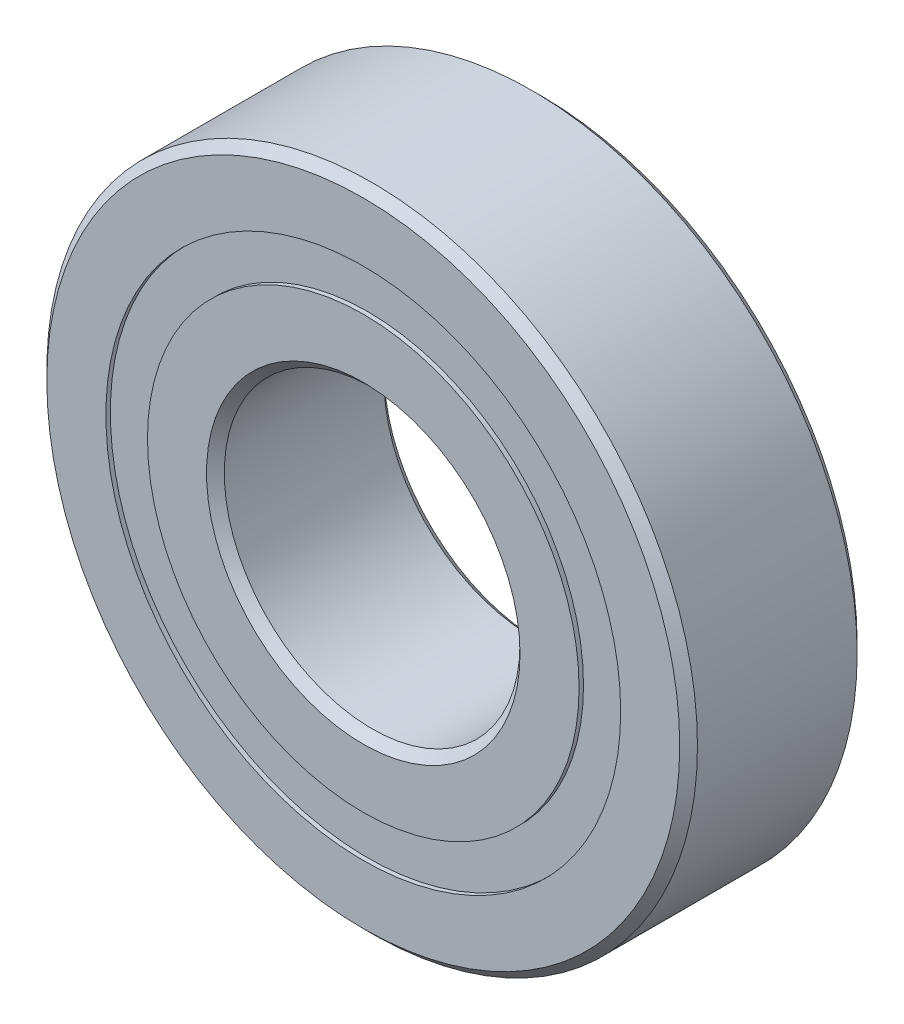
ISO-10303-21;
HEADER;
FILE_DESCRIPTION(('STEP AP214'),'2;1');
FILE_NAME('part.step','',(''),(''),'','','');
FILE_SCHEMA(('AUTOMOTIVE_DESIGN { 1 0 10303 214 1 1 1 1 }'));
ENDSEC;
DATA;
#1=APPLICATION_CONTEXT('core data for automotive mechanical design processes');
#2=APPLICATION_PROTOCOL_DEFINITION('international standard','automotive_design',2000,#1);
#3=PRODUCT_CONTEXT('',#1,'mechanical');
#4=PRODUCT('Part','Part','',(#3));
#5=PRODUCT_RELATED_PRODUCT_CATEGORY('part','',(#4));
#6=PRODUCT_DEFINITION_FORMATION('','',#4);
#7=PRODUCT_DEFINITION_CONTEXT('part definition',#1,'design');
#8=PRODUCT_DEFINITION('design','',#6,#7);
#9=PRODUCT_DEFINITION_SHAPE('','',#8);
#10=(LENGTH_UNIT() NAMED_UNIT(*) SI_UNIT(.MILLI.,.METRE.));
#11=(NAMED_UNIT(*) PLANE_ANGLE_UNIT() SI_UNIT($,.RADIAN.));
#12=(NAMED_UNIT(*) SI_UNIT($,.STERADIAN.) SOLID_ANGLE_UNIT());
#13=UNCERTAINTY_MEASURE_WITH_UNIT(LENGTH_MEASURE(1.E-05),#10,'distance_accuracy_value','');
#14=(GEOMETRIC_REPRESENTATION_CONTEXT(3) GLOBAL_UNCERTAINTY_ASSIGNED_CONTEXT((#13)) GLOBAL_UNIT_ASSIGNED_CONTEXT((#10,
#11,#12)) REPRESENTATION_CONTEXT('',''));
#15=CARTESIAN_POINT('',(0.,0.,0.));
#16=DIRECTION('',(0.,0.,1.));
#17=DIRECTION('',(1.,0.,0.));
#18=AXIS2_PLACEMENT_3D('',#15,#16,#17);
#19=CARTESIAN_POINT('',(0.,8.7032967032967,-2.85000000000001));
#20=DIRECTION('',(0.,0.,1.));
#21=DIRECTION('',(1.,0.,0.));
#22=AXIS2_PLACEMENT_3D('',#19,#20,#21);
#23=PLANE('',#22);
#24=CARTESIAN_POINT('',(0.,0.,-2.85));
#25=DIRECTION('',(0.,0.,1.));
#26=DIRECTION('',(1.,0.,0.));
#27=AXIS2_PLACEMENT_3D('',#24,#25,#26);
#28=CIRCLE('',#27,8.7032967032967);
#29=CARTESIAN_POINT('',(8.7032967032967,0.,-2.85));
#30=VERTEX_POINT('',#29);
#31=EDGE_CURVE('E56',#30,#30,#28,.T.);
#32=ORIENTED_EDGE('',*,*,#31,.F.);
#33=EDGE_LOOP('',(#32));
#34=FACE_BOUND('',#33,.T.);
#35=CARTESIAN_POINT('',(0.,0.,-2.85000000000001));
#36=DIRECTION('',(0.,0.,1.));
#37=DIRECTION('',(1.,0.,0.));
#38=AXIS2_PLACEMENT_3D('',#35,#36,#37);
#39=CIRCLE('',#38,7.2967032967033);
#40=CARTESIAN_POINT('',(7.2967032967033,0.,-2.85000000000001));
#41=VERTEX_POINT('',#40);
#42=EDGE_CURVE('E11',#41,#41,#39,.T.);
#43=ORIENTED_EDGE('',*,*,#42,.T.);
#44=EDGE_LOOP('',(#43));
#45=FACE_BOUND('',#44,.T.);
#46=ADVANCED_FACE('F42',(#34,#45),#23,.F.);
#47=CARTESIAN_POINT('',(0.,0.,3.));
#48=DIRECTION('',(0.,0.,1.));
#49=DIRECTION('',(1.,0.,0.));
#50=AXIS2_PLACEMENT_3D('',#47,#48,#49);
#51=CYLINDRICAL_SURFACE('',#50,7.2967032967033);
#52=ORIENTED_EDGE('',*,*,#42,.F.);
#53=EDGE_LOOP('',(#52));
#54=FACE_BOUND('',#53,.T.);
#55=CARTESIAN_POINT('',(0.,0.,-1.50744951180655));
#56=DIRECTION('',(0.,0.,1.));
#57=DIRECTION('',(1.,0.,0.));
#58=AXIS2_PLACEMENT_3D('',#55,#56,#57);
#59=CIRCLE('',#58,7.2967032967033);
#60=CARTESIAN_POINT('',(7.2967032967033,0.,-1.50744951180655));
#61=VERTEX_POINT('',#60);
#62=EDGE_CURVE('E48',#61,#61,#59,.T.);
#63=ORIENTED_EDGE('',*,*,#62,.T.);
#64=EDGE_LOOP('',(#63));
#65=FACE_BOUND('',#64,.T.);
#66=ADVANCED_FACE('F65',(#54,#65),#51,.F.);
#67=CARTESIAN_POINT('',(0.,8.7032967032967,-1.50744951180655));
#68=DIRECTION('',(0.,0.,-1.));
#69=DIRECTION('',(-1.,0.,0.));
#70=AXIS2_PLACEMENT_3D('',#67,#68,#69);
#71=PLANE('',#70);
#72=ORIENTED_EDGE('',*,*,#62,.F.);
#73=EDGE_LOOP('',(#72));
#74=FACE_BOUND('',#73,.T.);
#75=CARTESIAN_POINT('',(0.,0.,-1.50744951180655));
#76=DIRECTION('',(0.,0.,1.));
#77=DIRECTION('',(1.,0.,0.));
#78=AXIS2_PLACEMENT_3D('',#75,#76,#77);
#79=CIRCLE('',#78,8.7032967032967);
#80=CARTESIAN_POINT('',(8.7032967032967,0.,-1.50744951180655));
#81=VERTEX_POINT('',#80);
#82=EDGE_CURVE('E52',#81,#81,#79,.T.);
#83=ORIENTED_EDGE('',*,*,#82,.T.);
#84=EDGE_LOOP('',(#83));
#85=FACE_BOUND('',#84,.T.);
#86=ADVANCED_FACE('F69',(#74,#85),#71,.F.);
#87=CARTESIAN_POINT('',(0.,0.,3.));
#88=DIRECTION('',(0.,0.,1.));
#89=DIRECTION('',(1.,0.,0.));
#90=AXIS2_PLACEMENT_3D('',#87,#88,#89);
#91=CYLINDRICAL_SURFACE('',#90,8.7032967032967);
#92=ORIENTED_EDGE('',*,*,#82,.F.);
#93=EDGE_LOOP('',(#92));
#94=FACE_BOUND('',#93,.T.);
#95=ORIENTED_EDGE('',*,*,#31,.T.);
#96=EDGE_LOOP('',(#95));
#97=FACE_BOUND('',#96,.T.);
#98=ADVANCED_FACE('F62',(#94,#97),#91,.T.);
#99=CLOSED_SHELL('',(#46,#66,#86,#98));
#100=MANIFOLD_SOLID_BREP('B2',#99);
#101=CARTESIAN_POINT('',(0.,8.7032967032967,2.85));
#102=DIRECTION('',(0.,0.,-1.));
#103=DIRECTION('',(-1.,0.,0.));
#104=AXIS2_PLACEMENT_3D('',#101,#102,#103);
#105=PLANE('',#104);
#106=CARTESIAN_POINT('',(0.,0.,2.85));
#107=DIRECTION('',(0.,0.,1.));
#108=DIRECTION('',(1.,0.,0.));
#109=AXIS2_PLACEMENT_3D('',#106,#107,#108);
#110=CIRCLE('',#109,7.2967032967033);
#111=CARTESIAN_POINT('',(7.2967032967033,0.,2.85));
#112=VERTEX_POINT('',#111);
#113=EDGE_CURVE('E41',#112,#112,#110,.T.);
#114=ORIENTED_EDGE('',*,*,#113,.F.);
#115=EDGE_LOOP('',(#114));
#116=FACE_BOUND('',#115,.T.);
#117=CARTESIAN_POINT('',(0.,0.,2.85));
#118=DIRECTION('',(0.,0.,1.));
#119=DIRECTION('',(1.,0.,0.));
#120=AXIS2_PLACEMENT_3D('',#117,#118,#119);
#121=CIRCLE('',#120,8.7032967032967);
#122=CARTESIAN_POINT('',(8.7032967032967,0.,2.85));
#123=VERTEX_POINT('',#122);
#124=EDGE_CURVE('E124',#123,#123,#121,.T.);
#125=ORIENTED_EDGE('',*,*,#124,.T.);
#126=EDGE_LOOP('',(#125));
#127=FACE_BOUND('',#126,.T.);
#128=ADVANCED_FACE('F110',(#116,#127),#105,.F.);
#129=CARTESIAN_POINT('',(0.,0.,3.));
#130=DIRECTION('',(0.,0.,1.));
#131=DIRECTION('',(1.,0.,0.));
#132=AXIS2_PLACEMENT_3D('',#129,#130,#131);
#133=CYLINDRICAL_SURFACE('',#132,7.2967032967033);
#134=CARTESIAN_POINT('',(0.,0.,1.50744951180654));
#135=DIRECTION('',(0.,0.,1.));
#136=DIRECTION('',(1.,0.,0.));
#137=AXIS2_PLACEMENT_3D('',#134,#135,#136);
#138=CIRCLE('',#137,7.2967032967033);
#139=CARTESIAN_POINT('',(7.2967032967033,0.,1.50744951180654));
#140=VERTEX_POINT('',#139);
#141=EDGE_CURVE('E116',#140,#140,#138,.T.);
#142=ORIENTED_EDGE('',*,*,#141,.F.);
#143=EDGE_LOOP('',(#142));
#144=FACE_BOUND('',#143,.T.);
#145=ORIENTED_EDGE('',*,*,#113,.T.);
#146=EDGE_LOOP('',(#145));
#147=FACE_BOUND('',#146,.T.);
#148=ADVANCED_FACE('F139',(#144,#147),#133,.F.);
#149=CARTESIAN_POINT('',(0.,8.7032967032967,1.50744951180654));
#150=DIRECTION('',(0.,0.,1.));
#151=DIRECTION('',(1.,0.,0.));
#152=AXIS2_PLACEMENT_3D('',#149,#150,#151);
#153=PLANE('',#152);
#154=CARTESIAN_POINT('',(0.,0.,1.50744951180654));
#155=DIRECTION('',(0.,0.,1.));
#156=DIRECTION('',(1.,0.,0.));
#157=AXIS2_PLACEMENT_3D('',#154,#155,#156);
#158=CIRCLE('',#157,8.7032967032967);
#159=CARTESIAN_POINT('',(8.7032967032967,0.,1.50744951180654));
#160=VERTEX_POINT('',#159);
#161=EDGE_CURVE('E120',#160,#160,#158,.T.);
#162=ORIENTED_EDGE('',*,*,#161,.F.);
#163=EDGE_LOOP('',(#162));
#164=FACE_BOUND('',#163,.T.);
#165=ORIENTED_EDGE('',*,*,#141,.T.);
#166=EDGE_LOOP('',(#165));
#167=FACE_BOUND('',#166,.T.);
#168=ADVANCED_FACE('F134',(#164,#167),#153,.F.);
#169=CARTESIAN_POINT('',(0.,0.,3.));
#170=DIRECTION('',(0.,0.,1.));
#171=DIRECTION('',(1.,0.,0.));
#172=AXIS2_PLACEMENT_3D('',#169,#170,#171);
#173=CYLINDRICAL_SURFACE('',#172,8.7032967032967);
#174=ORIENTED_EDGE('',*,*,#124,.F.);
#175=EDGE_LOOP('',(#174));
#176=FACE_BOUND('',#175,.T.);
#177=ORIENTED_EDGE('',*,*,#161,.T.);
#178=EDGE_LOOP('',(#177));
#179=FACE_BOUND('',#178,.T.);
#180=ADVANCED_FACE('F131',(#176,#179),#173,.T.);
#181=CLOSED_SHELL('',(#128,#148,#168,#180));
#182=MANIFOLD_SOLID_BREP('B6',#181);
#183=CARTESIAN_POINT('',(-3.99999999999991,6.92820323027556,0.));
#184=DIRECTION('',(0.,0.,1.));
#185=DIRECTION('',(-0.499999999999989,0.866025403784445,0.));
#186=AXIS2_PLACEMENT_3D('',#183,#184,#185);
#187=SPHERICAL_SURFACE('',#186,1.50744951180654);
#188=CARTESIAN_POINT('',(-3.99999999999991,6.92820323027556,1.50744951180654));
#189=VERTEX_POINT('',#188);
#190=VERTEX_LOOP('',#189);
#191=FACE_BOUND('',#190,.T.);
#192=ADVANCED_FACE('F177',(#191),#187,.T.);
#193=CLOSED_SHELL('',(#192));
#194=MANIFOLD_SOLID_BREP('B36',#193);
#195=CARTESIAN_POINT('',(-6.92820323027546,4.00000000000008,0.));
#196=DIRECTION('',(0.,0.,1.));
#197=DIRECTION('',(-0.866025403784433,0.50000000000001,0.));
#198=AXIS2_PLACEMENT_3D('',#195,#196,#197);
#199=SPHERICAL_SURFACE('',#198,1.50744951180654);
#200=CARTESIAN_POINT('',(-6.92820323027546,4.00000000000008,1.50744951180654));
#201=VERTEX_POINT('',#200);
#202=VERTEX_LOOP('',#201);
#203=FACE_BOUND('',#202,.T.);
#204=ADVANCED_FACE('F197',(#203),#199,.T.);
#205=CLOSED_SHELL('',(#204));
#206=MANIFOLD_SOLID_BREP('B106',#205);
#207=CARTESIAN_POINT('',(-8.,0.,0.));
#208=DIRECTION('',(0.,0.,1.));
#209=DIRECTION('',(-1.,0.,0.));
#210=AXIS2_PLACEMENT_3D('',#207,#208,#209);
#211=SPHERICAL_SURFACE('',#210,1.50744951180654);
#212=CARTESIAN_POINT('',(-8.,0.,1.50744951180654));
#213=VERTEX_POINT('',#212);
#214=VERTEX_LOOP('',#213);
#215=FACE_BOUND('',#214,.T.);
#216=ADVANCED_FACE('F217',(#215),#211,.T.);
#217=CLOSED_SHELL('',(#216));
#218=MANIFOLD_SOLID_BREP('B173',#217);
#219=CARTESIAN_POINT('',(-6.92820323027555,-3.99999999999994,0.));
#220=DIRECTION('',(0.,0.,1.));
#221=DIRECTION('',(-0.866025403784443,-0.499999999999992,0.));
#222=AXIS2_PLACEMENT_3D('',#219,#220,#221);
#223=SPHERICAL_SURFACE('',#222,1.50744951180654);
#224=CARTESIAN_POINT('',(-6.92820323027555,-3.99999999999994,1.50744951180654));
#225=VERTEX_POINT('',#224);
#226=VERTEX_LOOP('',#225);
#227=FACE_BOUND('',#226,.T.);
#228=ADVANCED_FACE('F237',(#227),#223,.T.);
#229=CLOSED_SHELL('',(#228));
#230=MANIFOLD_SOLID_BREP('B193',#229);
#231=CARTESIAN_POINT('',(-4.00000000000006,-6.92820323027548,0.));
#232=DIRECTION('',(0.,0.,1.));
#233=DIRECTION('',(-0.500000000000007,-0.866025403784435,0.));
#234=AXIS2_PLACEMENT_3D('',#231,#232,#233);
#235=SPHERICAL_SURFACE('',#234,1.50744951180654);
#236=CARTESIAN_POINT('',(-4.00000000000006,-6.92820323027548,1.50744951180654));
#237=VERTEX_POINT('',#236);
#238=VERTEX_LOOP('',#237);
#239=FACE_BOUND('',#238,.T.);
#240=ADVANCED_FACE('F257',(#239),#235,.T.);
#241=CLOSED_SHELL('',(#240));
#242=MANIFOLD_SOLID_BREP('B213',#241);
#243=CARTESIAN_POINT('',(0.,-8.,0.));
#244=DIRECTION('',(0.,0.,1.));
#245=DIRECTION('',(0.,-1.,0.));
#246=AXIS2_PLACEMENT_3D('',#243,#244,#245);
#247=SPHERICAL_SURFACE('',#246,1.50744951180654);
#248=CARTESIAN_POINT('',(0.,-8.,1.50744951180654));
#249=VERTEX_POINT('',#248);
#250=VERTEX_LOOP('',#249);
#251=FACE_BOUND('',#250,.T.);
#252=ADVANCED_FACE('F277',(#251),#247,.T.);
#253=CLOSED_SHELL('',(#252));
#254=MANIFOLD_SOLID_BREP('B233',#253);
#255=CARTESIAN_POINT('',(3.99999999999996,-6.92820323027553,0.));
#256=DIRECTION('',(0.,0.,1.));
#257=DIRECTION('',(0.499999999999995,-0.866025403784442,0.));
#258=AXIS2_PLACEMENT_3D('',#255,#256,#257);
#259=SPHERICAL_SURFACE('',#258,1.50744951180654);
#260=CARTESIAN_POINT('',(3.99999999999996,-6.92820323027553,1.50744951180654));
#261=VERTEX_POINT('',#260);
#262=VERTEX_LOOP('',#261);
#263=FACE_BOUND('',#262,.T.);
#264=ADVANCED_FACE('F297',(#263),#259,.T.);
#265=CLOSED_SHELL('',(#264));
#266=MANIFOLD_SOLID_BREP('B253',#265);
#267=CARTESIAN_POINT('',(6.92820323027549,-4.00000000000003,0.));
#268=DIRECTION('',(0.,0.,1.));
#269=DIRECTION('',(0.866025403784436,-0.500000000000004,0.));
#270=AXIS2_PLACEMENT_3D('',#267,#268,#269);
#271=SPHERICAL_SURFACE('',#270,1.50744951180654);
#272=CARTESIAN_POINT('',(6.92820323027549,-4.00000000000003,1.50744951180654));
#273=VERTEX_POINT('',#272);
#274=VERTEX_LOOP('',#273);
#275=FACE_BOUND('',#274,.T.);
#276=ADVANCED_FACE('F317',(#275),#271,.T.);
#277=CLOSED_SHELL('',(#276));
#278=MANIFOLD_SOLID_BREP('B273',#277);
#279=CARTESIAN_POINT('',(8.,0.,0.));
#280=DIRECTION('',(0.,0.,1.));
#281=DIRECTION('',(1.,0.,0.));
#282=AXIS2_PLACEMENT_3D('',#279,#280,#281);
#283=SPHERICAL_SURFACE('',#282,1.50744951180654);
#284=CARTESIAN_POINT('',(8.,0.,1.50744951180654));
#285=VERTEX_POINT('',#284);
#286=VERTEX_LOOP('',#285);
#287=FACE_BOUND('',#286,.T.);
#288=ADVANCED_FACE('F337',(#287),#283,.T.);
#289=CLOSED_SHELL('',(#288));
#290=MANIFOLD_SOLID_BREP('B293',#289);
#291=CARTESIAN_POINT('',(6.92820323027552,3.99999999999998,0.));
#292=DIRECTION('',(0.,0.,1.));
#293=DIRECTION('',(0.86602540378444,0.499999999999998,0.));
#294=AXIS2_PLACEMENT_3D('',#291,#292,#293);
#295=SPHERICAL_SURFACE('',#294,1.50744951180654);
#296=CARTESIAN_POINT('',(6.92820323027552,3.99999999999998,1.50744951180654));
#297=VERTEX_POINT('',#296);
#298=VERTEX_LOOP('',#297);
#299=FACE_BOUND('',#298,.T.);
#300=ADVANCED_FACE('F357',(#299),#295,.T.);
#301=CLOSED_SHELL('',(#300));
#302=MANIFOLD_SOLID_BREP('B313',#301);
#303=CARTESIAN_POINT('',(4.00000000000001,6.9282032302755,0.));
#304=DIRECTION('',(0.,0.,1.));
#305=DIRECTION('',(0.500000000000001,0.866025403784438,0.));
#306=AXIS2_PLACEMENT_3D('',#303,#304,#305);
#307=SPHERICAL_SURFACE('',#306,1.50744951180654);
#308=CARTESIAN_POINT('',(4.00000000000001,6.9282032302755,1.50744951180654));
#309=VERTEX_POINT('',#308);
#310=VERTEX_LOOP('',#309);
#311=FACE_BOUND('',#310,.T.);
#312=ADVANCED_FACE('F377',(#311),#307,.T.);
#313=CLOSED_SHELL('',(#312));
#314=MANIFOLD_SOLID_BREP('B333',#313);
#315=CARTESIAN_POINT('',(0.,8.,0.));
#316=DIRECTION('',(0.,0.,1.));
#317=DIRECTION('',(0.,1.,0.));
#318=AXIS2_PLACEMENT_3D('',#315,#316,#317);
#319=SPHERICAL_SURFACE('',#318,1.50744951180654);
#320=CARTESIAN_POINT('',(0.,8.,1.50744951180654));
#321=VERTEX_POINT('',#320);
#322=VERTEX_LOOP('',#321);
#323=FACE_BOUND('',#322,.T.);
#324=ADVANCED_FACE('F400',(#323),#319,.T.);
#325=CLOSED_SHELL('',(#324));
#326=MANIFOLD_SOLID_BREP('B353',#325);
#327=CARTESIAN_POINT('',(0.,7.2967032967033,3.));
#328=DIRECTION('',(0.,0.,-1.));
#329=DIRECTION('',(-1.,0.,0.));
#330=AXIS2_PLACEMENT_3D('',#327,#328,#329);
#331=PLANE('',#330);
#332=CARTESIAN_POINT('',(0.,0.,3.));
#333=DIRECTION('',(0.,0.,1.));
#334=DIRECTION('',(1.,0.,0.));
#335=AXIS2_PLACEMENT_3D('',#332,#333,#334);
#336=CIRCLE('',#335,5.3);
#337=CARTESIAN_POINT('',(5.3,0.,3.));
#338=VERTEX_POINT('',#337);
#339=EDGE_CURVE('E448',#338,#338,#336,.T.);
#340=ORIENTED_EDGE('',*,*,#339,.F.);
#341=EDGE_LOOP('',(#340));
#342=FACE_BOUND('',#341,.T.);
#343=CARTESIAN_POINT('',(0.,0.,3.));
#344=DIRECTION('',(0.,0.,1.));
#345=DIRECTION('',(1.,0.,0.));
#346=AXIS2_PLACEMENT_3D('',#343,#344,#345);
#347=CIRCLE('',#346,7.2967032967033);
#348=CARTESIAN_POINT('',(7.2967032967033,0.,3.));
#349=VERTEX_POINT('',#348);
#350=EDGE_CURVE('E399',#349,#349,#347,.T.);
#351=ORIENTED_EDGE('',*,*,#350,.T.);
#352=EDGE_LOOP('',(#351));
#353=FACE_BOUND('',#352,.T.);
#354=ADVANCED_FACE('F420',(#342,#353),#331,.F.);
#355=CARTESIAN_POINT('',(0.,0.,3.));
#356=DIRECTION('',(0.,0.,1.));
#357=DIRECTION('',(1.,0.,0.));
#358=AXIS2_PLACEMENT_3D('',#355,#356,#357);
#359=CYLINDRICAL_SURFACE('',#358,7.2967032967033);
#360=ORIENTED_EDGE('',*,*,#350,.F.);
#361=EDGE_LOOP('',(#360));
#362=FACE_BOUND('',#361,.T.);
#363=CARTESIAN_POINT('',(0.,0.,1.33333333333333));
#364=DIRECTION('',(0.,0.,1.));
#365=DIRECTION('',(1.,0.,0.));
#366=AXIS2_PLACEMENT_3D('',#363,#364,#365);
#367=CIRCLE('',#366,7.2967032967033);
#368=CARTESIAN_POINT('',(7.2967032967033,0.,1.33333333333333));
#369=VERTEX_POINT('',#368);
#370=EDGE_CURVE('E426',#369,#369,#367,.T.);
#371=ORIENTED_EDGE('',*,*,#370,.T.);
#372=EDGE_LOOP('',(#371));
#373=FACE_BOUND('',#372,.T.);
#374=ADVANCED_FACE('F455',(#362,#373),#359,.T.);
#375=CARTESIAN_POINT('',(0.,0.,0.));
#376=DIRECTION('',(0.,0.,1.));
#377=DIRECTION('',(1.,0.,0.));
#378=AXIS2_PLACEMENT_3D('',#375,#376,#377);
#379=TOROIDAL_SURFACE('',#378,8.,1.50744951180654);
#380=ORIENTED_EDGE('',*,*,#370,.F.);
#381=EDGE_LOOP('',(#380));
#382=FACE_BOUND('',#381,.T.);
#383=CARTESIAN_POINT('',(0.,0.,-1.33333333333333));
#384=DIRECTION('',(0.,0.,1.));
#385=DIRECTION('',(1.,0.,0.));
#386=AXIS2_PLACEMENT_3D('',#383,#384,#385);
#387=CIRCLE('',#386,7.2967032967033);
#388=CARTESIAN_POINT('',(7.2967032967033,0.,-1.33333333333333));
#389=VERTEX_POINT('',#388);
#390=EDGE_CURVE('E430',#389,#389,#387,.T.);
#391=ORIENTED_EDGE('',*,*,#390,.T.);
#392=EDGE_LOOP('',(#391));
#393=FACE_BOUND('',#392,.T.);
#394=ADVANCED_FACE('F459',(#382,#393),#379,.F.);
#395=CARTESIAN_POINT('',(0.,0.,3.));
#396=DIRECTION('',(0.,0.,1.));
#397=DIRECTION('',(1.,0.,0.));
#398=AXIS2_PLACEMENT_3D('',#395,#396,#397);
#399=CYLINDRICAL_SURFACE('',#398,7.2967032967033);
#400=ORIENTED_EDGE('',*,*,#390,.F.);
#401=EDGE_LOOP('',(#400));
#402=FACE_BOUND('',#401,.T.);
#403=CARTESIAN_POINT('',(0.,0.,-3.));
#404=DIRECTION('',(0.,0.,1.));
#405=DIRECTION('',(1.,0.,0.));
#406=AXIS2_PLACEMENT_3D('',#403,#404,#405);
#407=CIRCLE('',#406,7.2967032967033);
#408=CARTESIAN_POINT('',(7.2967032967033,0.,-3.));
#409=VERTEX_POINT('',#408);
#410=EDGE_CURVE('E434',#409,#409,#407,.T.);
#411=ORIENTED_EDGE('',*,*,#410,.T.);
#412=EDGE_LOOP('',(#411));
#413=FACE_BOUND('',#412,.T.);
#414=ADVANCED_FACE('F464',(#402,#413),#399,.T.);
#415=CARTESIAN_POINT('',(0.,5.3,-3.));
#416=DIRECTION('',(0.,0.,1.));
#417=DIRECTION('',(1.,0.,0.));
#418=AXIS2_PLACEMENT_3D('',#415,#416,#417);
#419=PLANE('',#418);
#420=ORIENTED_EDGE('',*,*,#410,.F.);
#421=EDGE_LOOP('',(#420));
#422=FACE_BOUND('',#421,.T.);
#423=CARTESIAN_POINT('',(0.,0.,-3.));
#424=DIRECTION('',(0.,0.,1.));
#425=DIRECTION('',(1.,0.,0.));
#426=AXIS2_PLACEMENT_3D('',#423,#424,#425);
#427=CIRCLE('',#426,5.3);
#428=CARTESIAN_POINT('',(5.3,0.,-3.));
#429=VERTEX_POINT('',#428);
#430=EDGE_CURVE('E439',#429,#429,#427,.T.);
#431=ORIENTED_EDGE('',*,*,#430,.T.);
#432=EDGE_LOOP('',(#431));
#433=FACE_BOUND('',#432,.T.);
#434=ADVANCED_FACE('F470',(#422,#433),#419,.F.);
#435=CARTESIAN_POINT('',(0.,0.,-2.7));
#436=DIRECTION('',(0.,0.,-1.));
#437=DIRECTION('',(-1.,0.,0.));
#438=AXIS2_PLACEMENT_3D('',#435,#436,#437);
#439=CONICAL_SURFACE('',#438,5.,0.785398163397443);
#440=ORIENTED_EDGE('',*,*,#430,.F.);
#441=EDGE_LOOP('',(#440));
#442=FACE_BOUND('',#441,.T.);
#443=CARTESIAN_POINT('',(0.,0.,-2.7));
#444=DIRECTION('',(0.,0.,1.));
#445=DIRECTION('',(1.,0.,0.));
#446=AXIS2_PLACEMENT_3D('',#443,#444,#445);
#447=CIRCLE('',#446,5.);
#448=CARTESIAN_POINT('',(5.,0.,-2.7));
#449=VERTEX_POINT('',#448);
#450=EDGE_CURVE('E442',#449,#449,#447,.T.);
#451=ORIENTED_EDGE('',*,*,#450,.T.);
#452=EDGE_LOOP('',(#451));
#453=FACE_BOUND('',#452,.T.);
#454=ADVANCED_FACE('F474',(#442,#453),#439,.F.);
#455=CARTESIAN_POINT('',(0.,0.,3.));
#456=DIRECTION('',(0.,0.,1.));
#457=DIRECTION('',(1.,0.,0.));
#458=AXIS2_PLACEMENT_3D('',#455,#456,#457);
#459=CYLINDRICAL_SURFACE('',#458,5.);
#460=ORIENTED_EDGE('',*,*,#450,.F.);
#461=EDGE_LOOP('',(#460));
#462=FACE_BOUND('',#461,.T.);
#463=CARTESIAN_POINT('',(0.,0.,2.70000000000001));
#464=DIRECTION('',(0.,0.,1.));
#465=DIRECTION('',(1.,0.,0.));
#466=AXIS2_PLACEMENT_3D('',#463,#464,#465);
#467=CIRCLE('',#466,5.);
#468=CARTESIAN_POINT('',(5.,0.,2.70000000000001));
#469=VERTEX_POINT('',#468);
#470=EDGE_CURVE('E445',#469,#469,#467,.T.);
#471=ORIENTED_EDGE('',*,*,#470,.T.);
#472=EDGE_LOOP('',(#471));
#473=FACE_BOUND('',#472,.T.);
#474=ADVANCED_FACE('F478',(#462,#473),#459,.F.);
#475=CARTESIAN_POINT('',(0.,0.,3.));
#476=DIRECTION('',(0.,0.,1.));
#477=DIRECTION('',(1.,0.,0.));
#478=AXIS2_PLACEMENT_3D('',#475,#476,#477);
#479=CONICAL_SURFACE('',#478,5.3,0.785398163397455);
#480=ORIENTED_EDGE('',*,*,#470,.F.);
#481=EDGE_LOOP('',(#480));
#482=FACE_BOUND('',#481,.T.);
#483=ORIENTED_EDGE('',*,*,#339,.T.);
#484=EDGE_LOOP('',(#483));
#485=FACE_BOUND('',#484,.T.);
#486=ADVANCED_FACE('F452',(#482,#485),#479,.F.);
#487=CLOSED_SHELL('',(#354,#374,#394,#414,#434,#454,#474,#486));
#488=MANIFOLD_SOLID_BREP('B373',#487);
#489=CARTESIAN_POINT('',(0.,0.,2.7));
#490=DIRECTION('',(0.,0.,-1.));
#491=DIRECTION('',(-1.,0.,0.));
#492=AXIS2_PLACEMENT_3D('',#489,#490,#491);
#493=CONICAL_SURFACE('',#492,11.,0.785398163397443);
#494=CARTESIAN_POINT('',(0.,0.,3.));
#495=DIRECTION('',(0.,0.,1.));
#496=DIRECTION('',(1.,0.,0.));
#497=AXIS2_PLACEMENT_3D('',#494,#495,#496);
#498=CIRCLE('',#497,10.7);
#499=CARTESIAN_POINT('',(10.7,0.,3.));
#500=VERTEX_POINT('',#499);
#501=EDGE_CURVE('E570',#500,#500,#498,.T.);
#502=ORIENTED_EDGE('',*,*,#501,.F.);
#503=EDGE_LOOP('',(#502));
#504=FACE_BOUND('',#503,.T.);
#505=CARTESIAN_POINT('',(0.,0.,2.7));
#506=DIRECTION('',(0.,0.,1.));
#507=DIRECTION('',(1.,0.,0.));
#508=AXIS2_PLACEMENT_3D('',#505,#506,#507);
#509=CIRCLE('',#508,11.);
#510=CARTESIAN_POINT('',(11.,0.,2.7));
#511=VERTEX_POINT('',#510);
#512=EDGE_CURVE('E419',#511,#511,#509,.T.);
#513=ORIENTED_EDGE('',*,*,#512,.T.);
#514=EDGE_LOOP('',(#513));
#515=FACE_BOUND('',#514,.T.);
#516=ADVANCED_FACE('F542',(#504,#515),#493,.T.);
#517=CARTESIAN_POINT('',(0.,0.,3.));
#518=DIRECTION('',(0.,0.,1.));
#519=DIRECTION('',(1.,0.,0.));
#520=AXIS2_PLACEMENT_3D('',#517,#518,#519);
#521=CYLINDRICAL_SURFACE('',#520,11.);
#522=ORIENTED_EDGE('',*,*,#512,.F.);
#523=EDGE_LOOP('',(#522));
#524=FACE_BOUND('',#523,.T.);
#525=CARTESIAN_POINT('',(0.,0.,-2.7));
#526=DIRECTION('',(0.,0.,1.));
#527=DIRECTION('',(1.,0.,0.));
#528=AXIS2_PLACEMENT_3D('',#525,#526,#527);
#529=CIRCLE('',#528,11.);
#530=CARTESIAN_POINT('',(11.,0.,-2.7));
#531=VERTEX_POINT('',#530);
#532=EDGE_CURVE('E548',#531,#531,#529,.T.);
#533=ORIENTED_EDGE('',*,*,#532,.T.);
#534=EDGE_LOOP('',(#533));
#535=FACE_BOUND('',#534,.T.);
#536=ADVANCED_FACE('F577',(#524,#535),#521,.T.);
#537=CARTESIAN_POINT('',(0.,0.,-3.));
#538=DIRECTION('',(0.,0.,1.));
#539=DIRECTION('',(1.,0.,0.));
#540=AXIS2_PLACEMENT_3D('',#537,#538,#539);
#541=CONICAL_SURFACE('',#540,10.7,0.785398163397443);
#542=ORIENTED_EDGE('',*,*,#532,.F.);
#543=EDGE_LOOP('',(#542));
#544=FACE_BOUND('',#543,.T.);
#545=CARTESIAN_POINT('',(0.,0.,-3.));
#546=DIRECTION('',(0.,0.,1.));
#547=DIRECTION('',(1.,0.,0.));
#548=AXIS2_PLACEMENT_3D('',#545,#546,#547);
#549=CIRCLE('',#548,10.7);
#550=CARTESIAN_POINT('',(10.7,0.,-3.));
#551=VERTEX_POINT('',#550);
#552=EDGE_CURVE('E552',#551,#551,#549,.T.);
#553=ORIENTED_EDGE('',*,*,#552,.T.);
#554=EDGE_LOOP('',(#553));
#555=FACE_BOUND('',#554,.T.);
#556=ADVANCED_FACE('F581',(#544,#555),#541,.T.);
#557=CARTESIAN_POINT('',(0.,10.7,-3.));
#558=DIRECTION('',(0.,0.,1.));
#559=DIRECTION('',(1.,0.,0.));
#560=AXIS2_PLACEMENT_3D('',#557,#558,#559);
#561=PLANE('',#560);
#562=ORIENTED_EDGE('',*,*,#552,.F.);
#563=EDGE_LOOP('',(#562));
#564=FACE_BOUND('',#563,.T.);
#565=CARTESIAN_POINT('',(0.,0.,-3.));
#566=DIRECTION('',(0.,0.,1.));
#567=DIRECTION('',(1.,0.,0.));
#568=AXIS2_PLACEMENT_3D('',#565,#566,#567);
#569=CIRCLE('',#568,8.7032967032967);
#570=CARTESIAN_POINT('',(8.7032967032967,0.,-3.));
#571=VERTEX_POINT('',#570);
#572=EDGE_CURVE('E556',#571,#571,#569,.T.);
#573=ORIENTED_EDGE('',*,*,#572,.T.);
#574=EDGE_LOOP('',(#573));
#575=FACE_BOUND('',#574,.T.);
#576=ADVANCED_FACE('F586',(#564,#575),#561,.F.);
#577=CARTESIAN_POINT('',(0.,0.,3.));
#578=DIRECTION('',(0.,0.,1.));
#579=DIRECTION('',(1.,0.,0.));
#580=AXIS2_PLACEMENT_3D('',#577,#578,#579);
#581=CYLINDRICAL_SURFACE('',#580,8.7032967032967);
#582=ORIENTED_EDGE('',*,*,#572,.F.);
#583=EDGE_LOOP('',(#582));
#584=FACE_BOUND('',#583,.T.);
#585=CARTESIAN_POINT('',(0.,0.,-1.33333333333333));
#586=DIRECTION('',(0.,0.,1.));
#587=DIRECTION('',(1.,0.,0.));
#588=AXIS2_PLACEMENT_3D('',#585,#586,#587);
#589=CIRCLE('',#588,8.7032967032967);
#590=CARTESIAN_POINT('',(8.7032967032967,0.,-1.33333333333333));
#591=VERTEX_POINT('',#590);
#592=EDGE_CURVE('E561',#591,#591,#589,.T.);
#593=ORIENTED_EDGE('',*,*,#592,.T.);
#594=EDGE_LOOP('',(#593));
#595=FACE_BOUND('',#594,.T.);
#596=ADVANCED_FACE('F592',(#584,#595),#581,.F.);
#597=CARTESIAN_POINT('',(0.,0.,0.));
#598=DIRECTION('',(0.,0.,1.));
#599=DIRECTION('',(1.,0.,0.));
#600=AXIS2_PLACEMENT_3D('',#597,#598,#599);
#601=TOROIDAL_SURFACE('',#600,8.,1.50744951180654);
#602=ORIENTED_EDGE('',*,*,#592,.F.);
#603=EDGE_LOOP('',(#602));
#604=FACE_BOUND('',#603,.T.);
#605=CARTESIAN_POINT('',(0.,0.,1.33333333333333));
#606=DIRECTION('',(0.,0.,1.));
#607=DIRECTION('',(1.,0.,0.));
#608=AXIS2_PLACEMENT_3D('',#605,#606,#607);
#609=CIRCLE('',#608,8.7032967032967);
#610=CARTESIAN_POINT('',(8.7032967032967,0.,1.33333333333333));
#611=VERTEX_POINT('',#610);
#612=EDGE_CURVE('E564',#611,#611,#609,.T.);
#613=ORIENTED_EDGE('',*,*,#612,.T.);
#614=EDGE_LOOP('',(#613));
#615=FACE_BOUND('',#614,.T.);
#616=ADVANCED_FACE('F596',(#604,#615),#601,.F.);
#617=CARTESIAN_POINT('',(0.,0.,3.));
#618=DIRECTION('',(0.,0.,1.));
#619=DIRECTION('',(1.,0.,0.));
#620=AXIS2_PLACEMENT_3D('',#617,#618,#619);
#621=CYLINDRICAL_SURFACE('',#620,8.7032967032967);
#622=ORIENTED_EDGE('',*,*,#612,.F.);
#623=EDGE_LOOP('',(#622));
#624=FACE_BOUND('',#623,.T.);
#625=CARTESIAN_POINT('',(0.,0.,3.));
#626=DIRECTION('',(0.,0.,1.));
#627=DIRECTION('',(1.,0.,0.));
#628=AXIS2_PLACEMENT_3D('',#625,#626,#627);
#629=CIRCLE('',#628,8.7032967032967);
#630=CARTESIAN_POINT('',(8.7032967032967,0.,3.));
#631=VERTEX_POINT('',#630);
#632=EDGE_CURVE('E567',#631,#631,#629,.T.);
#633=ORIENTED_EDGE('',*,*,#632,.T.);
#634=EDGE_LOOP('',(#633));
#635=FACE_BOUND('',#634,.T.);
#636=ADVANCED_FACE('F600',(#624,#635),#621,.F.);
#637=CARTESIAN_POINT('',(0.,10.7,3.));
#638=DIRECTION('',(0.,0.,-1.));
#639=DIRECTION('',(-1.,0.,0.));
#640=AXIS2_PLACEMENT_3D('',#637,#638,#639);
#641=PLANE('',#640);
#642=ORIENTED_EDGE('',*,*,#632,.F.);
#643=EDGE_LOOP('',(#642));
#644=FACE_BOUND('',#643,.T.);
#645=ORIENTED_EDGE('',*,*,#501,.T.);
#646=EDGE_LOOP('',(#645));
#647=FACE_BOUND('',#646,.T.);
#648=ADVANCED_FACE('F574',(#644,#647),#641,.F.);
#649=CLOSED_SHELL('',(#516,#536,#556,#576,#596,#616,#636,#648));
#650=MANIFOLD_SOLID_BREP('B394',#649);
#651=ADVANCED_BREP_SHAPE_REPRESENTATION('',(#18,#100,#182,#194,#206,#218,#230,#242,#254,#266,
#278,#290,#302,#314,#326,#488,#650),#14);
#652=SHAPE_DEFINITION_REPRESENTATION(#9,#651);
ENDSEC;
END-ISO-10303-21;
